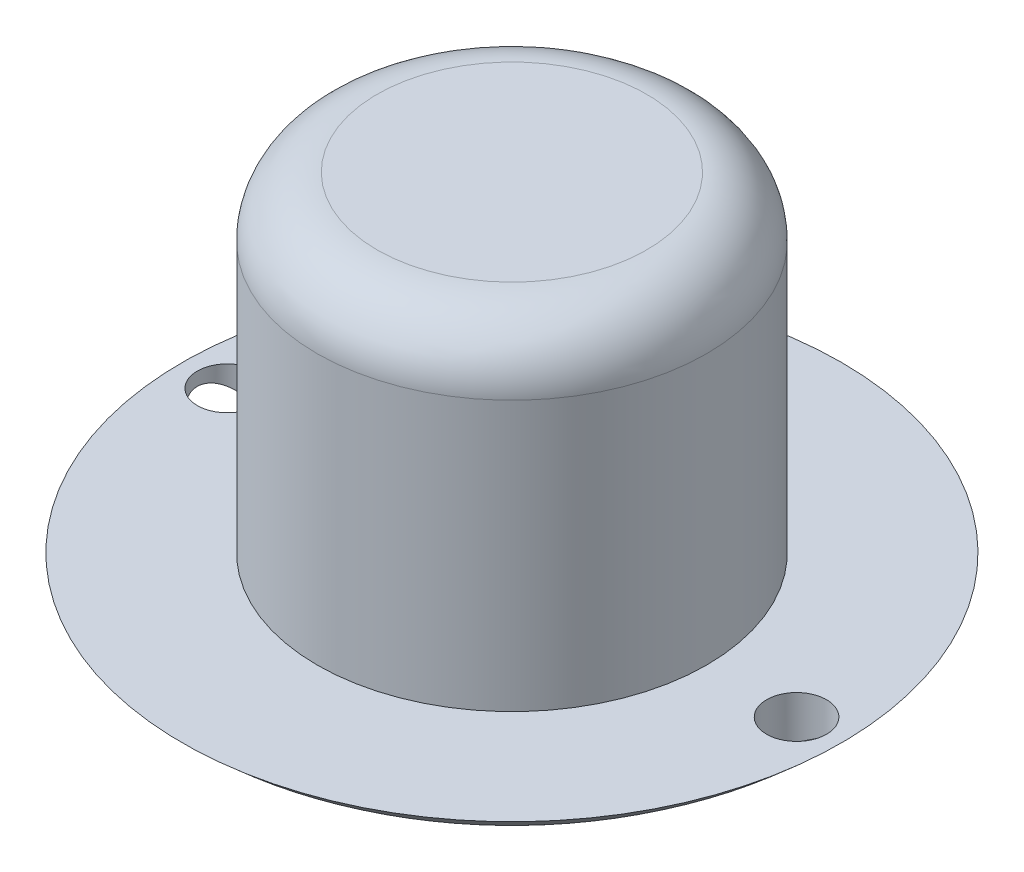
ISO-10303-21;
HEADER;
FILE_DESCRIPTION(('STEP AP214'),'2;1');
FILE_NAME('part.step','',(''),(''),'','','');
FILE_SCHEMA(('AUTOMOTIVE_DESIGN { 1 0 10303 214 1 1 1 1 }'));
ENDSEC;
DATA;
#1=APPLICATION_CONTEXT('core data for automotive mechanical design processes');
#2=APPLICATION_PROTOCOL_DEFINITION('international standard','automotive_design',2000,#1);
#3=PRODUCT_CONTEXT('',#1,'mechanical');
#4=PRODUCT('Part','Part','',(#3));
#5=PRODUCT_RELATED_PRODUCT_CATEGORY('part','',(#4));
#6=PRODUCT_DEFINITION_FORMATION('','',#4);
#7=PRODUCT_DEFINITION_CONTEXT('part definition',#1,'design');
#8=PRODUCT_DEFINITION('design','',#6,#7);
#9=PRODUCT_DEFINITION_SHAPE('','',#8);
#10=(LENGTH_UNIT() NAMED_UNIT(*) SI_UNIT(.MILLI.,.METRE.));
#11=(NAMED_UNIT(*) PLANE_ANGLE_UNIT() SI_UNIT($,.RADIAN.));
#12=(NAMED_UNIT(*) SI_UNIT($,.STERADIAN.) SOLID_ANGLE_UNIT());
#13=UNCERTAINTY_MEASURE_WITH_UNIT(LENGTH_MEASURE(1.E-05),#10,'distance_accuracy_value','');
#14=(GEOMETRIC_REPRESENTATION_CONTEXT(3) GLOBAL_UNCERTAINTY_ASSIGNED_CONTEXT((#13)) GLOBAL_UNIT_ASSIGNED_CONTEXT((#10,
#11,#12)) REPRESENTATION_CONTEXT('',''));
#15=CARTESIAN_POINT('',(0.,0.,0.));
#16=DIRECTION('',(0.,0.,1.));
#17=DIRECTION('',(1.,0.,0.));
#18=AXIS2_PLACEMENT_3D('',#15,#16,#17);
#19=CARTESIAN_POINT('',(0.,11.,0.));
#20=DIRECTION('',(0.,-1.,0.));
#21=DIRECTION('',(0.,0.,-1.));
#22=AXIS2_PLACEMENT_3D('',#19,#20,#21);
#23=CYLINDRICAL_SURFACE('',#22,6.5);
#24=CARTESIAN_POINT('',(0.,9.,0.));
#25=DIRECTION('',(0.,1.,0.));
#26=DIRECTION('',(0.,0.,1.));
#27=AXIS2_PLACEMENT_3D('',#24,#25,#26);
#28=CIRCLE('',#27,6.5);
#29=CARTESIAN_POINT('',(0.,9.,6.5));
#30=VERTEX_POINT('',#29);
#31=EDGE_CURVE('E10',#30,#30,#28,.F.);
#32=ORIENTED_EDGE('',*,*,#31,.T.);
#33=EDGE_LOOP('',(#32));
#34=FACE_BOUND('',#33,.T.);
#35=CARTESIAN_POINT('',(0.,0.,0.));
#36=DIRECTION('',(0.,-1.,0.));
#37=DIRECTION('',(0.,0.,-1.));
#38=AXIS2_PLACEMENT_3D('',#35,#36,#37);
#39=CIRCLE('',#38,6.5);
#40=CARTESIAN_POINT('',(0.,0.,-6.5));
#41=VERTEX_POINT('',#40);
#42=EDGE_CURVE('E48',#41,#41,#39,.T.);
#43=ORIENTED_EDGE('',*,*,#42,.F.);
#44=EDGE_LOOP('',(#43));
#45=FACE_BOUND('',#44,.T.);
#46=ADVANCED_FACE('F33',(#34,#45),#23,.T.);
#47=CARTESIAN_POINT('',(0.,11.,0.));
#48=DIRECTION('',(0.,1.,0.));
#49=DIRECTION('',(0.,0.,1.));
#50=AXIS2_PLACEMENT_3D('',#47,#48,#49);
#51=PLANE('',#50);
#52=CARTESIAN_POINT('',(0.,11.,0.));
#53=DIRECTION('',(0.,1.,0.));
#54=DIRECTION('',(0.,0.,1.));
#55=AXIS2_PLACEMENT_3D('',#52,#53,#54);
#56=CIRCLE('',#55,4.5);
#57=CARTESIAN_POINT('',(0.,11.,4.5));
#58=VERTEX_POINT('',#57);
#59=EDGE_CURVE('E40',#58,#58,#56,.T.);
#60=ORIENTED_EDGE('',*,*,#59,.T.);
#61=EDGE_LOOP('',(#60));
#62=FACE_BOUND('',#61,.T.);
#63=ADVANCED_FACE('F80',(#62),#51,.T.);
#64=CARTESIAN_POINT('',(0.,0.,0.));
#65=DIRECTION('',(0.,-1.,0.));
#66=DIRECTION('',(0.,0.,-1.));
#67=AXIS2_PLACEMENT_3D('',#64,#65,#66);
#68=PLANE('',#67);
#69=CARTESIAN_POINT('',(9.5,0.,0.));
#70=DIRECTION('',(0.,1.,0.));
#71=DIRECTION('',(0.,0.,1.));
#72=AXIS2_PLACEMENT_3D('',#69,#70,#71);
#73=CIRCLE('',#72,1.);
#74=CARTESIAN_POINT('',(9.5,0.,1.));
#75=VERTEX_POINT('',#74);
#76=EDGE_CURVE('E59',#75,#75,#73,.T.);
#77=ORIENTED_EDGE('',*,*,#76,.F.);
#78=EDGE_LOOP('',(#77));
#79=FACE_BOUND('',#78,.T.);
#80=CARTESIAN_POINT('',(-9.5,0.,0.));
#81=DIRECTION('',(0.,1.,0.));
#82=DIRECTION('',(0.,0.,1.));
#83=AXIS2_PLACEMENT_3D('',#80,#81,#82);
#84=CIRCLE('',#83,1.);
#85=CARTESIAN_POINT('',(-9.5,0.,1.));
#86=VERTEX_POINT('',#85);
#87=EDGE_CURVE('E58',#86,#86,#84,.T.);
#88=ORIENTED_EDGE('',*,*,#87,.F.);
#89=EDGE_LOOP('',(#88));
#90=FACE_BOUND('',#89,.T.);
#91=CARTESIAN_POINT('',(0.,0.,0.));
#92=DIRECTION('',(0.,-1.,0.));
#93=DIRECTION('',(0.,0.,-1.));
#94=AXIS2_PLACEMENT_3D('',#91,#92,#93);
#95=CIRCLE('',#94,11.);
#96=CARTESIAN_POINT('',(0.,0.,-11.));
#97=VERTEX_POINT('',#96);
#98=EDGE_CURVE('E90',#97,#97,#95,.T.);
#99=ORIENTED_EDGE('',*,*,#98,.F.);
#100=EDGE_LOOP('',(#99));
#101=FACE_BOUND('',#100,.T.);
#102=ORIENTED_EDGE('',*,*,#42,.T.);
#103=EDGE_LOOP('',(#102));
#104=FACE_BOUND('',#103,.T.);
#105=ADVANCED_FACE('F76',(#79,#90,#101,#104),#68,.F.);
#106=CARTESIAN_POINT('',(0.,2.70374188625669,0.));
#107=DIRECTION('',(0.,0.,1.));
#108=DIRECTION('',(1.,0.,0.));
#109=AXIS2_PLACEMENT_3D('',#106,#107,#108);
#110=SPHERICAL_SURFACE('',#109,7.70374188625669);
#111=CARTESIAN_POINT('',(0.,2.70374188625669,0.));
#112=DIRECTION('',(0.,-1.,0.));
#113=DIRECTION('',(0.,0.,-1.));
#114=AXIS2_PLACEMENT_3D('',#111,#112,#113);
#115=SPHERICAL_SURFACE('',#114,7.70374188625669);
#116=CARTESIAN_POINT('',(0.,-2.,0.));
#117=DIRECTION('',(0.,-1.,0.));
#118=DIRECTION('',(0.,0.,-1.));
#119=AXIS2_PLACEMENT_3D('',#116,#117,#118);
#120=CIRCLE('',#119,6.10102051443364);
#121=CARTESIAN_POINT('',(0.,-2.,-6.10102051443364));
#122=VERTEX_POINT('',#121);
#123=EDGE_CURVE('E44',#122,#122,#120,.T.);
#124=ORIENTED_EDGE('',*,*,#123,.T.);
#125=EDGE_LOOP('',(#124));
#126=FACE_BOUND('',#125,.T.);
#127=ADVANCED_FACE('F79',(#126),#115,.T.);
#128=CARTESIAN_POINT('',(0.,5.,0.));
#129=DIRECTION('',(0.,1.,0.));
#130=DIRECTION('',(0.,0.,1.));
#131=AXIS2_PLACEMENT_3D('',#128,#129,#130);
#132=DEGENERATE_TOROIDAL_SURFACE('',#131,6.10102051443364,7.,.T.);
#133=CARTESIAN_POINT('',(8.73583303709421,-1.47548327354406,-0.645018490694956));
#134=CARTESIAN_POINT('',(8.77353798780215,-1.45869395374539,-0.689683168352575));
#135=CARTESIAN_POINT('',(8.81483896309626,-1.43996614286983,-0.730638413956055));
#136=CARTESIAN_POINT('',(8.90286971001922,-1.399076674189,-0.804200008686093));
#137=CARTESIAN_POINT('',(8.94960778347788,-1.37690974756224,-0.836793340339974));
#138=CARTESIAN_POINT('',(9.04654431956387,-1.32978938737843,-0.89303019687883));
#139=CARTESIAN_POINT('',(9.09672606844586,-1.30484909239972,-0.916713771693563));
#140=CARTESIAN_POINT('',(9.19919411398947,-1.25267349256721,-0.955256209362485));
#141=CARTESIAN_POINT('',(9.25148016797666,-1.22543845195611,-0.970116086694418));
#142=CARTESIAN_POINT('',(9.3615724045413,-1.16672858921728,-0.992100698043623));
#143=CARTESIAN_POINT('',(9.41945400820802,-1.1350924340814,-0.998414630868821));
#144=CARTESIAN_POINT('',(9.53472719304799,-1.0705329465991,-1.00106046057771));
#145=CARTESIAN_POINT('',(9.59211852329351,-1.0376089982149,-0.99738752106044));
#146=CARTESIAN_POINT('',(9.71081385854842,-0.967940608984422,-0.979545577959278));
#147=CARTESIAN_POINT('',(9.77193636520945,-0.931142939388825,-0.964365179684804));
#148=CARTESIAN_POINT('',(9.89059954909919,-0.858038286599222,-0.922708260225194));
#149=CARTESIAN_POINT('',(9.94813702385675,-0.821731764176313,-0.896221800653179));
#150=CARTESIAN_POINT('',(10.0597380783014,-0.749842572866667,-0.831259543703591));
#151=CARTESIAN_POINT('',(10.1136387532771,-0.714317200400302,-0.792437647254399));
#152=CARTESIAN_POINT('',(10.213883755691,-0.647032719962465,-0.703451399315308));
#153=CARTESIAN_POINT('',(10.2602418148774,-0.615266797123931,-0.653308065853849));
#154=CARTESIAN_POINT('',(10.3310549519299,-0.566046722084478,-0.558371587275005));
#155=CARTESIAN_POINT('',(10.357976205667,-0.547102878882399,-0.516180707396522));
#156=CARTESIAN_POINT('',(10.4056806809752,-0.513262630945069,-0.426960000586979));
#157=CARTESIAN_POINT('',(10.4264686065198,-0.49836312509903,-0.379933919552755));
#158=CARTESIAN_POINT('',(10.4609361005256,-0.473527717819694,-0.28165778678636));
#159=CARTESIAN_POINT('',(10.4745622762907,-0.463629120044098,-0.230379218255355));
#160=CARTESIAN_POINT('',(10.4935153315047,-0.449832327303551,-0.12552883227721));
#161=CARTESIAN_POINT('',(10.4988486567481,-0.445929472048513,-0.0719588292102123));
#162=CARTESIAN_POINT('',(10.5006963805553,-0.444578399834321,0.0288119369821071));
#163=CARTESIAN_POINT('',(10.4982118868018,-0.446397454984774,0.07598830691912));
#164=CARTESIAN_POINT('',(10.486714631735,-0.454785113663306,0.169096813286994));
#165=CARTESIAN_POINT('',(10.4777021784903,-0.461353493060327,0.215029008327086));
#166=CARTESIAN_POINT('',(10.4539154033212,-0.478589074862745,0.303482640302041));
#167=CARTESIAN_POINT('',(10.4392646001467,-0.489168341918383,0.346055093285241));
#168=CARTESIAN_POINT('',(10.404872918356,-0.513814601213386,0.427997110381289));
#169=CARTESIAN_POINT('',(10.3851305484828,-0.527882615217109,0.467365731679838));
#170=CARTESIAN_POINT('',(10.3387411435854,-0.560634612189843,0.546681355343859));
#171=CARTESIAN_POINT('',(10.3115605483018,-0.579663741977408,0.586172002989508));
#172=CARTESIAN_POINT('',(10.2526861706616,-0.620385753570164,0.66007524612146));
#173=CARTESIAN_POINT('',(10.2209897756077,-0.642080176421207,0.694484878259821));
#174=CARTESIAN_POINT('',(10.1478914790999,-0.691438600142713,0.763675544025942));
#175=CARTESIAN_POINT('',(10.1057670621353,-0.719476938757692,0.797426512520158));
#176=CARTESIAN_POINT('',(10.0174726125392,-0.777214437027318,0.85736430138417));
#177=CARTESIAN_POINT('',(9.97129999827222,-0.806914652069709,0.883546248396371));
#178=CARTESIAN_POINT('',(9.86821589440417,-0.871966844528837,0.93174530827513));
#179=CARTESIAN_POINT('',(9.81076762810669,-0.907463328036226,0.952427580815205));
#180=CARTESIAN_POINT('',(9.69306699613518,-0.97847771761026,0.983069945425174));
#181=CARTESIAN_POINT('',(9.63281316278062,-1.01399562507378,0.993024358152932));
#182=CARTESIAN_POINT('',(9.50685751130088,-1.08640226226708,1.00209676578743));
#183=CARTESIAN_POINT('',(9.44105982006262,-1.12322513442526,1.0004503059467));
#184=CARTESIAN_POINT('',(9.30986457256373,-1.1946331347074,0.983979421604138));
#185=CARTESIAN_POINT('',(9.24446695639839,-1.2292186056586,0.969157021149373));
#186=CARTESIAN_POINT('',(9.11960045338575,-1.29342539780365,0.927049914727354));
#187=CARTESIAN_POINT('',(9.0599980724569,-1.32320690283549,0.90041127554702));
#188=CARTESIAN_POINT('',(8.94580693978059,-1.37879658575232,0.834978117462442));
#189=CARTESIAN_POINT('',(8.89121386316492,-1.40460820437881,0.796194214526414));
#190=CARTESIAN_POINT('',(8.79558504212947,-1.44875607065807,0.712302106752291));
#191=CARTESIAN_POINT('',(8.75371323655044,-1.46760908704701,0.668419139186653));
#192=CARTESIAN_POINT('',(8.67803244005202,-1.50106996756892,0.572781243357293));
#193=CARTESIAN_POINT('',(8.64421743458363,-1.51568100021249,0.521032234809323));
#194=CARTESIAN_POINT('',(8.58945611347616,-1.53902181757089,0.417121531393895));
#195=CARTESIAN_POINT('',(8.56752960889196,-1.54820891839103,0.365577207626205));
#196=CARTESIAN_POINT('',(8.53251644992119,-1.56276721639228,0.259062708655025));
#197=CARTESIAN_POINT('',(8.51942600606808,-1.56814004942596,0.204094013102567));
#198=CARTESIAN_POINT('',(8.50319735878238,-1.57478578935733,0.0958942939314532));
#199=CARTESIAN_POINT('',(8.49950431214356,-1.57628734258137,0.0427597205719479));
#200=CARTESIAN_POINT('',(8.50060231123071,-1.57583971675551,-0.0634111664171296));
#201=CARTESIAN_POINT('',(8.50539312803838,-1.57389063081349,-0.116447482659299));
#202=CARTESIAN_POINT('',(8.52309419546143,-1.56663224000654,-0.219913338260558));
#203=CARTESIAN_POINT('',(8.53585716538948,-1.56138387627391,-0.270372580257783));
#204=CARTESIAN_POINT('',(8.56885461341354,-1.54765148428112,-0.368284262522714));
#205=CARTESIAN_POINT('',(8.58908365756143,-1.53916980913809,-0.415738860270826));
#206=CARTESIAN_POINT('',(8.62986304567367,-1.52180604903018,-0.494226077202592));
#207=CARTESIAN_POINT('',(8.64886119086595,-1.51364629181726,-0.526240739745298));
#208=CARTESIAN_POINT('',(8.6900477447871,-1.49573853343467,-0.587660726271816));
#209=CARTESIAN_POINT('',(8.71223617748449,-1.48599052033244,-0.617066030648943));
#210=CARTESIAN_POINT('',(8.73583303709421,-1.47548327354406,-0.645018490694956));
#211=B_SPLINE_CURVE_WITH_KNOTS('',3,(#133,#134,#135,#136,#137,#138,#139,#140,#141,#142,#143,
#144,#145,#146,#147,#148,#149,#150,#151,#152,#153,#154,#155,#156,#157,#158,#159,#160,#161,#162,
#163,#164,#165,#166,#167,#168,#169,#170,#171,#172,#173,#174,#175,#176,#177,#178,#179,#180,#181,
#182,#183,#184,#185,#186,#187,#188,#189,#190,#191,#192,#193,#194,#195,#196,#197,#198,#199,#200,
#201,#202,#203,#204,#205,#206,#207,#208,#209,#210),.UNSPECIFIED.,.T.,.F.,(4,2,2,2,2,2,2,2,2,2,2,
2,2,2,2,2,2,2,2,2,2,2,2,2,2,2,2,2,2,2,2,2,2,2,2,2,2,2,4),(0.,0.182293187416213,0.36486846230311,
0.546612954863982,0.728336547857472,0.926315215691181,1.12438977688396,1.34224171746546,
1.56028555245395,1.78508628272214,2.00947305717033,2.16938893122645,2.32918183661129,
2.49014972107991,2.65099242718106,2.79211429276858,2.93322949893951,3.0714147350871,
3.20964049003514,3.36379834071206,3.51804574714587,3.69982621201542,3.88172345792598,
4.09269828294957,4.30378474352097,4.52890519132004,4.75399106279051,4.968050553603,
5.18192345847241,5.37141159137488,5.56075782156636,5.730163925759,5.89949733156849,
6.05857297347804,6.21764432314797,6.37386047183321,6.5299631469825,6.64404669176148,
6.75813109369028),.UNSPECIFIED.);
#212=CARTESIAN_POINT('',(8.73583303709421,-1.47548327354406,-0.645018490694956));
#213=VERTEX_POINT('',#212);
#214=EDGE_CURVE('E51',#213,#213,#211,.T.);
#215=ORIENTED_EDGE('',*,*,#214,.F.);
#216=EDGE_LOOP('',(#215));
#217=FACE_BOUND('',#216,.T.);
#218=CARTESIAN_POINT('',(-9.67729523638243,-0.987553139656058,-0.984160850670896));
#219=CARTESIAN_POINT('',(-9.60463998636581,-1.0305257305019,-0.997248259453834));
#220=CARTESIAN_POINT('',(-9.5302728811821,-1.07324210512973,-1.00233386306457));
#221=CARTESIAN_POINT('',(-9.38089399064605,-1.15640217642477,-0.995692331743312));
#222=CARTESIAN_POINT('',(-9.30588167825271,-1.19684376050586,-0.983949828057182));
#223=CARTESIAN_POINT('',(-9.16959334416165,-1.26801337816326,-0.946076848087583));
#224=CARTESIAN_POINT('',(-9.10793671903006,-1.29929068201361,-0.922352442211798));
#225=CARTESIAN_POINT('',(-8.98914634272562,-1.35795505263618,-0.862231835017073));
#226=CARTESIAN_POINT('',(-8.93200582000026,-1.38534799465355,-0.825855064988903));
#227=CARTESIAN_POINT('',(-8.83119779407777,-1.43248347996751,-0.745893982178148));
#228=CARTESIAN_POINT('',(-8.78673666955571,-1.4527431845304,-0.703615457954283));
#229=CARTESIAN_POINT('',(-8.7056346037824,-1.48898723369912,-0.610559429652578));
#230=CARTESIAN_POINT('',(-8.66898829520124,-1.50497451459105,-0.559787801806617));
#231=CARTESIAN_POINT('',(-8.60894586988822,-1.53077543899315,-0.457333594778561));
#232=CARTESIAN_POINT('',(-8.58453562913778,-1.54107474842087,-0.406365611080387));
#233=CARTESIAN_POINT('',(-8.54453881668025,-1.55779824884814,-0.300484850483366));
#234=CARTESIAN_POINT('',(-8.52894818668029,-1.5642242222302,-0.245573901047046));
#235=CARTESIAN_POINT('',(-8.50804519175524,-1.57280808235094,-0.137334751048132));
#236=CARTESIAN_POINT('',(-8.50211735854375,-1.57522175789967,-0.0841447624286876));
#237=CARTESIAN_POINT('',(-8.49883168710401,-1.57656179189055,0.0225388973926194));
#238=CARTESIAN_POINT('',(-8.50147215122784,-1.57548884114246,0.0760325063413577));
#239=CARTESIAN_POINT('',(-8.51504868148002,-1.56993477128252,0.180505706661513));
#240=CARTESIAN_POINT('',(-8.52579168949373,-1.5655329619126,0.231514827218914));
#241=CARTESIAN_POINT('',(-8.55491224619225,-1.55347017652564,0.330893047468324));
#242=CARTESIAN_POINT('',(-8.573289726169,-1.54580922983989,0.379262170915115));
#243=CARTESIAN_POINT('',(-8.6172334469981,-1.527220771582,0.472673278926162));
#244=CARTESIAN_POINT('',(-8.642884685083,-1.51625453462476,0.517667453304598));
#245=CARTESIAN_POINT('',(-8.70031264530774,-1.49126496506803,0.602602565255958));
#246=CARTESIAN_POINT('',(-8.73209029029311,-1.47724117185474,0.642542740021177));
#247=CARTESIAN_POINT('',(-8.80228254151529,-1.44565004177729,0.71831823574826));
#248=CARTESIAN_POINT('',(-8.84093875502712,-1.42794721805568,0.753872687164751));
#249=CARTESIAN_POINT('',(-8.92244579821412,-1.38979823526105,0.817999520962966));
#250=CARTESIAN_POINT('',(-8.96529791421376,-1.36935123419775,0.846569752769555));
#251=CARTESIAN_POINT('',(-9.05760178129229,-1.32431940445996,0.898506917313385));
#252=CARTESIAN_POINT('',(-9.10730624084857,-1.29953221531277,0.921248070125217));
#253=CARTESIAN_POINT('',(-9.20869809591049,-1.2477481261949,0.958153413304377));
#254=CARTESIAN_POINT('',(-9.26038633594403,-1.22075027944083,0.972313906694931));
#255=CARTESIAN_POINT('',(-9.37009219736598,-1.16210622302599,0.993261385188425));
#256=CARTESIAN_POINT('',(-9.42819239252337,-1.13027243225522,0.999090960913718));
#257=CARTESIAN_POINT('',(-9.54382604862024,-1.06535053237002,1.00071328844052));
#258=CARTESIAN_POINT('',(-9.60135925395899,-1.03226188747285,0.996501704407304));
#259=CARTESIAN_POINT('',(-9.72016784231676,-0.962351656575256,0.977492177220034));
#260=CARTESIAN_POINT('',(-9.78125726337358,-0.925482079205406,0.961697029198864));
#261=CARTESIAN_POINT('',(-9.89976272891697,-0.85229774821673,0.91878476421985));
#262=CARTESIAN_POINT('',(-9.95717548909956,-0.815983512119924,0.891657682943304));
#263=CARTESIAN_POINT('',(-10.0682637423324,-0.744261434304505,0.825455521981892));
#264=CARTESIAN_POINT('',(-10.1217876821737,-0.708908245553239,0.786064327104714));
#265=CARTESIAN_POINT('',(-10.2211743805656,-0.642068658333349,0.695979178799315));
#266=CARTESIAN_POINT('',(-10.2670514925666,-0.610575045379045,0.645306828114828));
#267=CARTESIAN_POINT('',(-10.3367915037405,-0.562023843974953,0.549720731539258));
#268=CARTESIAN_POINT('',(-10.3631766862847,-0.543431396112757,0.507416803092027));
#269=CARTESIAN_POINT('',(-10.4098052828541,-0.510315267806433,0.418074929034938));
#270=CARTESIAN_POINT('',(-10.430053509663,-0.495788399701954,0.371040731799645));
#271=CARTESIAN_POINT('',(-10.4634538469481,-0.471703303410079,0.272876963929352));
#272=CARTESIAN_POINT('',(-10.4765537912115,-0.462181619679281,0.221720333520517));
#273=CARTESIAN_POINT('',(-10.4945133442632,-0.449103081909992,0.11724036778758));
#274=CARTESIAN_POINT('',(-10.4993789901126,-0.44554185791974,0.0639186492167428));
#275=CARTESIAN_POINT('',(-10.5004420096221,-0.444764309070832,-0.0364284524217198));
#276=CARTESIAN_POINT('',(-10.4976092479383,-0.446838070236788,-0.0834417906255365));
#277=CARTESIAN_POINT('',(-10.4854707107032,-0.455691485420764,-0.176161517767348));
#278=CARTESIAN_POINT('',(-10.4761650982413,-0.462471020872544,-0.221867939604073));
#279=CARTESIAN_POINT('',(-10.4518110126273,-0.480109647692369,-0.31002360525335));
#280=CARTESIAN_POINT('',(-10.4368603156449,-0.490899235315023,-0.352514288966864));
#281=CARTESIAN_POINT('',(-10.4018912772836,-0.515942156231114,-0.434246526363022));
#282=CARTESIAN_POINT('',(-10.3818716118333,-0.530196394491194,-0.473487227554076));
#283=CARTESIAN_POINT('',(-10.3348661581443,-0.563353734471932,-0.552591548686081));
#284=CARTESIAN_POINT('',(-10.3073376335228,-0.582606632270851,-0.591984253626945));
#285=CARTESIAN_POINT('',(-10.2477717902859,-0.623759222103877,-0.66564633011219));
#286=CARTESIAN_POINT('',(-10.2157309138614,-0.645661000731719,-0.699911614491285));
#287=CARTESIAN_POINT('',(-10.1418631478025,-0.695468154891149,-0.768763775420016));
#288=CARTESIAN_POINT('',(-10.0993120612276,-0.72374546563273,-0.802304150699409));
#289=CARTESIAN_POINT('',(-10.0102098405361,-0.781908233544514,-0.861715425261307));
#290=CARTESIAN_POINT('',(-9.96366001875118,-0.811793161921594,-0.887588828432096));
#291=CARTESIAN_POINT('',(-9.87750852026974,-0.866048121057457,-0.926951521789305));
#292=CARTESIAN_POINT('',(-9.83847285448665,-0.890273816516016,-0.94189696576625));
#293=CARTESIAN_POINT('',(-9.75890633667581,-0.938877957026667,-0.966803667391415));
#294=CARTESIAN_POINT('',(-9.7183744055739,-0.963256501360157,-0.976761249409471));
#295=CARTESIAN_POINT('',(-9.67729523638243,-0.987553139656058,-0.984160850670896));
#296=B_SPLINE_CURVE_WITH_KNOTS('',3,(#218,#219,#220,#221,#222,#223,#224,#225,#226,#227,#228,
#229,#230,#231,#232,#233,#234,#235,#236,#237,#238,#239,#240,#241,#242,#243,#244,#245,#246,#247,
#248,#249,#250,#251,#252,#253,#254,#255,#256,#257,#258,#259,#260,#261,#262,#263,#264,#265,#266,
#267,#268,#269,#270,#271,#272,#273,#274,#275,#276,#277,#278,#279,#280,#281,#282,#283,#284,#285,
#286,#287,#288,#289,#290,#291,#292,#293,#294,#295),.UNSPECIFIED.,.T.,.F.,(4,2,2,2,2,2,2,2,2,2,2,
2,2,2,2,2,2,2,2,2,2,2,2,2,2,2,2,2,2,2,2,2,2,2,2,2,2,2,4),(0.,0.256035538390748,
0.512305057687863,0.730367967191902,0.948097447357235,1.14084625399047,1.3334622484912,
1.50488962039958,1.67623804669745,1.83617280821863,1.99607588359169,2.15228480412531,
2.30849231885403,2.46660625250147,2.62474402212828,2.79030850253282,2.95592389938132,
3.13523680696729,3.31462691668246,3.51332066043537,3.71210021691062,3.93036403371136,
4.14882017810996,4.37345260313942,4.59765851488841,4.75667167696771,4.91555981157812,
5.07559246783083,5.23550774357084,5.37623878714193,5.51696628499582,5.65536048698542,
5.79379087645622,5.94852447831318,6.10338077167805,6.2860362390366,6.46863198866016,
6.61328765468313,6.75804976338381),.UNSPECIFIED.);
#297=CARTESIAN_POINT('',(-9.67729523638243,-0.987553139656058,-0.984160850670896));
#298=VERTEX_POINT('',#297);
#299=EDGE_CURVE('E60',#298,#298,#296,.T.);
#300=ORIENTED_EDGE('',*,*,#299,.F.);
#301=EDGE_LOOP('',(#300));
#302=FACE_BOUND('',#301,.T.);
#303=ORIENTED_EDGE('',*,*,#98,.T.);
#304=EDGE_LOOP('',(#303));
#305=FACE_BOUND('',#304,.T.);
#306=ORIENTED_EDGE('',*,*,#123,.F.);
#307=EDGE_LOOP('',(#306));
#308=FACE_BOUND('',#307,.T.);
#309=ADVANCED_FACE('F64',(#217,#302,#305,#308),#132,.T.);
#310=CARTESIAN_POINT('',(-9.5,-2.,0.));
#311=DIRECTION('',(0.,1.,0.));
#312=DIRECTION('',(0.,0.,1.));
#313=AXIS2_PLACEMENT_3D('',#310,#311,#312);
#314=CYLINDRICAL_SURFACE('',#313,1.);
#315=ORIENTED_EDGE('',*,*,#299,.T.);
#316=EDGE_LOOP('',(#315));
#317=FACE_BOUND('',#316,.T.);
#318=ORIENTED_EDGE('',*,*,#87,.T.);
#319=EDGE_LOOP('',(#318));
#320=FACE_BOUND('',#319,.T.);
#321=ADVANCED_FACE('F70',(#317,#320),#314,.F.);
#322=CARTESIAN_POINT('',(9.5,-2.,0.));
#323=DIRECTION('',(0.,1.,0.));
#324=DIRECTION('',(0.,0.,1.));
#325=AXIS2_PLACEMENT_3D('',#322,#323,#324);
#326=CYLINDRICAL_SURFACE('',#325,1.);
#327=ORIENTED_EDGE('',*,*,#214,.T.);
#328=EDGE_LOOP('',(#327));
#329=FACE_BOUND('',#328,.T.);
#330=ORIENTED_EDGE('',*,*,#76,.T.);
#331=EDGE_LOOP('',(#330));
#332=FACE_BOUND('',#331,.T.);
#333=ADVANCED_FACE('F67',(#329,#332),#326,.F.);
#334=CARTESIAN_POINT('',(0.,9.,0.));
#335=DIRECTION('',(0.,1.,0.));
#336=DIRECTION('',(0.,0.,1.));
#337=AXIS2_PLACEMENT_3D('',#334,#335,#336);
#338=TOROIDAL_SURFACE('',#337,4.5,2.);
#339=ORIENTED_EDGE('',*,*,#31,.F.);
#340=EDGE_LOOP('',(#339));
#341=FACE_BOUND('',#340,.T.);
#342=ORIENTED_EDGE('',*,*,#59,.F.);
#343=EDGE_LOOP('',(#342));
#344=FACE_BOUND('',#343,.T.);
#345=ADVANCED_FACE('F35',(#341,#344),#338,.T.);
#346=CLOSED_SHELL('',(#46,#63,#105,#127,#309,#321,#333,#345));
#347=MANIFOLD_SOLID_BREP('B2',#346);
#348=ADVANCED_BREP_SHAPE_REPRESENTATION('',(#18,#347),#14);
#349=SHAPE_DEFINITION_REPRESENTATION(#9,#348);
ENDSEC;
END-ISO-10303-21;
